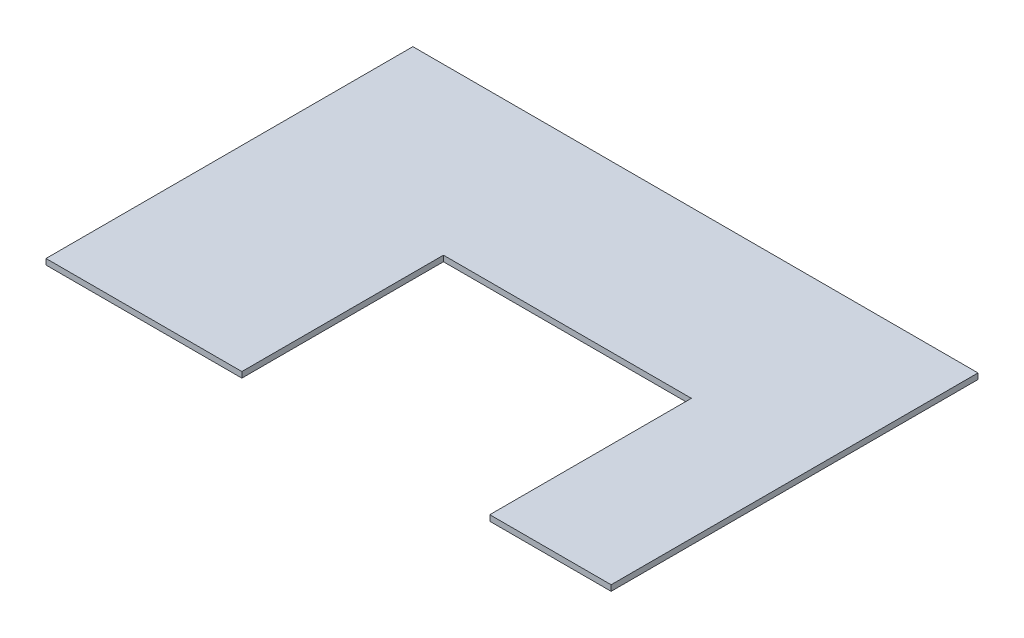
ISO-10303-21;
HEADER;
FILE_DESCRIPTION(('STEP AP214'),'2;1');
FILE_NAME('part.step','',(''),(''),'','','');
FILE_SCHEMA(('AUTOMOTIVE_DESIGN { 1 0 10303 214 1 1 1 1 }'));
ENDSEC;
DATA;
#1=APPLICATION_CONTEXT('core data for automotive mechanical design processes');
#2=APPLICATION_PROTOCOL_DEFINITION('international standard','automotive_design',2000,#1);
#3=PRODUCT_CONTEXT('',#1,'mechanical');
#4=PRODUCT('Part','Part','',(#3));
#5=PRODUCT_RELATED_PRODUCT_CATEGORY('part','',(#4));
#6=PRODUCT_DEFINITION_FORMATION('','',#4);
#7=PRODUCT_DEFINITION_CONTEXT('part definition',#1,'design');
#8=PRODUCT_DEFINITION('design','',#6,#7);
#9=PRODUCT_DEFINITION_SHAPE('','',#8);
#10=(LENGTH_UNIT() NAMED_UNIT(*) SI_UNIT(.MILLI.,.METRE.));
#11=(NAMED_UNIT(*) PLANE_ANGLE_UNIT() SI_UNIT($,.RADIAN.));
#12=(NAMED_UNIT(*) SI_UNIT($,.STERADIAN.) SOLID_ANGLE_UNIT());
#13=UNCERTAINTY_MEASURE_WITH_UNIT(LENGTH_MEASURE(1.E-05),#10,'distance_accuracy_value','');
#14=(GEOMETRIC_REPRESENTATION_CONTEXT(3) GLOBAL_UNCERTAINTY_ASSIGNED_CONTEXT((#13)) GLOBAL_UNIT_ASSIGNED_CONTEXT((#10,
#11,#12)) REPRESENTATION_CONTEXT('',''));
#15=CARTESIAN_POINT('',(0.,0.,0.));
#16=DIRECTION('',(0.,0.,1.));
#17=DIRECTION('',(1.,0.,0.));
#18=AXIS2_PLACEMENT_3D('',#15,#16,#17);
#19=CARTESIAN_POINT('',(0.,-19.05,0.));
#20=DIRECTION('',(0.,0.,1.));
#21=DIRECTION('',(1.,0.,0.));
#22=AXIS2_PLACEMENT_3D('',#19,#20,#21);
#23=PLANE('',#22);
#24=DIRECTION('',(1.,0.,0.));
#25=VECTOR('',#24,1.);
#26=CARTESIAN_POINT('',(0.,0.,0.));
#27=LINE('',#26,#25);
#28=CARTESIAN_POINT('',(0.,0.,0.));
#29=VERTEX_POINT('',#28);
#30=CARTESIAN_POINT('',(650.875,0.,0.));
#31=VERTEX_POINT('',#30);
#32=EDGE_CURVE('E135',#29,#31,#27,.T.);
#33=ORIENTED_EDGE('',*,*,#32,.F.);
#34=DIRECTION('',(0.,1.,0.));
#35=VECTOR('',#34,1.);
#36=CARTESIAN_POINT('',(0.,-19.05,0.));
#37=LINE('',#36,#35);
#38=CARTESIAN_POINT('',(0.,-19.05,0.));
#39=VERTEX_POINT('',#38);
#40=EDGE_CURVE('E11',#39,#29,#37,.T.);
#41=ORIENTED_EDGE('',*,*,#40,.F.);
#42=DIRECTION('',(1.,0.,0.));
#43=VECTOR('',#42,1.);
#44=CARTESIAN_POINT('',(0.,-19.05,0.));
#45=LINE('',#44,#43);
#46=CARTESIAN_POINT('',(650.875,-19.05,0.));
#47=VERTEX_POINT('',#46);
#48=EDGE_CURVE('E155',#39,#47,#45,.T.);
#49=ORIENTED_EDGE('',*,*,#48,.T.);
#50=DIRECTION('',(0.,1.,0.));
#51=VECTOR('',#50,1.);
#52=CARTESIAN_POINT('',(650.875,-19.05,0.));
#53=LINE('',#52,#51);
#54=EDGE_CURVE('E41',#47,#31,#53,.T.);
#55=ORIENTED_EDGE('',*,*,#54,.T.);
#56=EDGE_LOOP('',(#33,#41,#49,#55));
#57=FACE_BOUND('',#56,.T.);
#58=ADVANCED_FACE('F38',(#57),#23,.T.);
#59=CARTESIAN_POINT('',(-2.29534139493609E-13,-19.05,-1219.2));
#60=DIRECTION('',(-1.,0.,0.));
#61=DIRECTION('',(0.,0.,1.));
#62=AXIS2_PLACEMENT_3D('',#59,#60,#61);
#63=PLANE('',#62);
#64=DIRECTION('',(0.,0.,1.));
#65=VECTOR('',#64,1.);
#66=CARTESIAN_POINT('',(-2.29534139493609E-13,0.,-1219.2));
#67=LINE('',#66,#65);
#68=CARTESIAN_POINT('',(-2.29534139493609E-13,0.,-1219.2));
#69=VERTEX_POINT('',#68);
#70=EDGE_CURVE('E153',#69,#29,#67,.T.);
#71=ORIENTED_EDGE('',*,*,#70,.F.);
#72=DIRECTION('',(0.,1.,0.));
#73=VECTOR('',#72,1.);
#74=CARTESIAN_POINT('',(-2.29534139493609E-13,-19.05,-1219.2));
#75=LINE('',#74,#73);
#76=CARTESIAN_POINT('',(-2.29534139493609E-13,-19.05,-1219.2));
#77=VERTEX_POINT('',#76);
#78=EDGE_CURVE('E47',#77,#69,#75,.T.);
#79=ORIENTED_EDGE('',*,*,#78,.F.);
#80=DIRECTION('',(0.,0.,1.));
#81=VECTOR('',#80,1.);
#82=CARTESIAN_POINT('',(-2.29534139493609E-13,-19.05,-1219.2));
#83=LINE('',#82,#81);
#84=EDGE_CURVE('E125',#77,#39,#83,.T.);
#85=ORIENTED_EDGE('',*,*,#84,.T.);
#86=ORIENTED_EDGE('',*,*,#40,.T.);
#87=EDGE_LOOP('',(#71,#79,#85,#86));
#88=FACE_BOUND('',#87,.T.);
#89=ADVANCED_FACE('F167',(#88),#63,.T.);
#90=CARTESIAN_POINT('',(1878.0125,-19.05,-1219.2));
#91=DIRECTION('',(0.,0.,-1.));
#92=DIRECTION('',(-1.,0.,0.));
#93=AXIS2_PLACEMENT_3D('',#90,#91,#92);
#94=PLANE('',#93);
#95=DIRECTION('',(-1.,0.,0.));
#96=VECTOR('',#95,1.);
#97=CARTESIAN_POINT('',(1878.0125,0.,-1219.2));
#98=LINE('',#97,#96);
#99=CARTESIAN_POINT('',(1878.0125,0.,-1219.2));
#100=VERTEX_POINT('',#99);
#101=EDGE_CURVE('E112',#100,#69,#98,.T.);
#102=ORIENTED_EDGE('',*,*,#101,.F.);
#103=DIRECTION('',(0.,1.,0.));
#104=VECTOR('',#103,1.);
#105=CARTESIAN_POINT('',(1878.0125,-19.05,-1219.2));
#106=LINE('',#105,#104);
#107=CARTESIAN_POINT('',(1878.0125,-19.05,-1219.2));
#108=VERTEX_POINT('',#107);
#109=EDGE_CURVE('E107',#108,#100,#106,.T.);
#110=ORIENTED_EDGE('',*,*,#109,.F.);
#111=DIRECTION('',(-1.,0.,0.));
#112=VECTOR('',#111,1.);
#113=CARTESIAN_POINT('',(1878.0125,-19.05,-1219.2));
#114=LINE('',#113,#112);
#115=EDGE_CURVE('E110',#108,#77,#114,.T.);
#116=ORIENTED_EDGE('',*,*,#115,.T.);
#117=ORIENTED_EDGE('',*,*,#78,.T.);
#118=EDGE_LOOP('',(#102,#110,#116,#117));
#119=FACE_BOUND('',#118,.T.);
#120=ADVANCED_FACE('F109',(#119),#94,.T.);
#121=CARTESIAN_POINT('',(1878.0125,-19.05,0.));
#122=DIRECTION('',(1.,0.,0.));
#123=DIRECTION('',(0.,0.,-1.));
#124=AXIS2_PLACEMENT_3D('',#121,#122,#123);
#125=PLANE('',#124);
#126=DIRECTION('',(0.,0.,-1.));
#127=VECTOR('',#126,1.);
#128=CARTESIAN_POINT('',(1878.0125,0.,0.));
#129=LINE('',#128,#127);
#130=CARTESIAN_POINT('',(1878.0125,0.,0.));
#131=VERTEX_POINT('',#130);
#132=EDGE_CURVE('E150',#131,#100,#129,.T.);
#133=ORIENTED_EDGE('',*,*,#132,.F.);
#134=DIRECTION('',(0.,1.,0.));
#135=VECTOR('',#134,1.);
#136=CARTESIAN_POINT('',(1878.0125,-19.05,0.));
#137=LINE('',#136,#135);
#138=CARTESIAN_POINT('',(1878.0125,-19.05,0.));
#139=VERTEX_POINT('',#138);
#140=EDGE_CURVE('E117',#139,#131,#137,.T.);
#141=ORIENTED_EDGE('',*,*,#140,.F.);
#142=DIRECTION('',(0.,0.,-1.));
#143=VECTOR('',#142,1.);
#144=CARTESIAN_POINT('',(1878.0125,-19.05,0.));
#145=LINE('',#144,#143);
#146=EDGE_CURVE('E123',#139,#108,#145,.T.);
#147=ORIENTED_EDGE('',*,*,#146,.T.);
#148=ORIENTED_EDGE('',*,*,#109,.T.);
#149=EDGE_LOOP('',(#133,#141,#147,#148));
#150=FACE_BOUND('',#149,.T.);
#151=ADVANCED_FACE('F127',(#150),#125,.T.);
#152=CARTESIAN_POINT('',(1474.7875,-19.05,0.));
#153=DIRECTION('',(0.,0.,1.));
#154=DIRECTION('',(1.,0.,0.));
#155=AXIS2_PLACEMENT_3D('',#152,#153,#154);
#156=PLANE('',#155);
#157=DIRECTION('',(1.,0.,0.));
#158=VECTOR('',#157,1.);
#159=CARTESIAN_POINT('',(1474.7875,0.,0.));
#160=LINE('',#159,#158);
#161=CARTESIAN_POINT('',(1474.7875,0.,0.));
#162=VERTEX_POINT('',#161);
#163=EDGE_CURVE('E147',#162,#131,#160,.T.);
#164=ORIENTED_EDGE('',*,*,#163,.F.);
#165=DIRECTION('',(0.,1.,0.));
#166=VECTOR('',#165,1.);
#167=CARTESIAN_POINT('',(1474.7875,-19.05,0.));
#168=LINE('',#167,#166);
#169=CARTESIAN_POINT('',(1474.7875,-19.05,0.));
#170=VERTEX_POINT('',#169);
#171=EDGE_CURVE('E159',#170,#162,#168,.T.);
#172=ORIENTED_EDGE('',*,*,#171,.F.);
#173=DIRECTION('',(1.,0.,0.));
#174=VECTOR('',#173,1.);
#175=CARTESIAN_POINT('',(1474.7875,-19.05,0.));
#176=LINE('',#175,#174);
#177=EDGE_CURVE('E128',#170,#139,#176,.T.);
#178=ORIENTED_EDGE('',*,*,#177,.T.);
#179=ORIENTED_EDGE('',*,*,#140,.T.);
#180=EDGE_LOOP('',(#164,#172,#178,#179));
#181=FACE_BOUND('',#180,.T.);
#182=ADVANCED_FACE('F180',(#181),#156,.T.);
#183=CARTESIAN_POINT('',(1474.7875,-19.05,-669.925));
#184=DIRECTION('',(-1.,0.,0.));
#185=DIRECTION('',(0.,0.,1.));
#186=AXIS2_PLACEMENT_3D('',#183,#184,#185);
#187=PLANE('',#186);
#188=DIRECTION('',(0.,0.,1.));
#189=VECTOR('',#188,1.);
#190=CARTESIAN_POINT('',(1474.7875,0.,-669.925));
#191=LINE('',#190,#189);
#192=CARTESIAN_POINT('',(1474.7875,0.,-669.925));
#193=VERTEX_POINT('',#192);
#194=EDGE_CURVE('E144',#193,#162,#191,.T.);
#195=ORIENTED_EDGE('',*,*,#194,.F.);
#196=DIRECTION('',(0.,1.,0.));
#197=VECTOR('',#196,1.);
#198=CARTESIAN_POINT('',(1474.7875,-19.05,-669.925));
#199=LINE('',#198,#197);
#200=CARTESIAN_POINT('',(1474.7875,-19.05,-669.925));
#201=VERTEX_POINT('',#200);
#202=EDGE_CURVE('E161',#201,#193,#199,.T.);
#203=ORIENTED_EDGE('',*,*,#202,.F.);
#204=DIRECTION('',(0.,0.,1.));
#205=VECTOR('',#204,1.);
#206=CARTESIAN_POINT('',(1474.7875,-19.05,-669.925));
#207=LINE('',#206,#205);
#208=EDGE_CURVE('E130',#201,#170,#207,.T.);
#209=ORIENTED_EDGE('',*,*,#208,.T.);
#210=ORIENTED_EDGE('',*,*,#171,.T.);
#211=EDGE_LOOP('',(#195,#203,#209,#210));
#212=FACE_BOUND('',#211,.T.);
#213=ADVANCED_FACE('F183',(#212),#187,.T.);
#214=CARTESIAN_POINT('',(650.875,-19.05,-669.925));
#215=DIRECTION('',(0.,0.,1.));
#216=DIRECTION('',(1.,0.,0.));
#217=AXIS2_PLACEMENT_3D('',#214,#215,#216);
#218=PLANE('',#217);
#219=DIRECTION('',(1.,0.,0.));
#220=VECTOR('',#219,1.);
#221=CARTESIAN_POINT('',(650.875,0.,-669.925));
#222=LINE('',#221,#220);
#223=CARTESIAN_POINT('',(650.875,0.,-669.925));
#224=VERTEX_POINT('',#223);
#225=EDGE_CURVE('E141',#224,#193,#222,.T.);
#226=ORIENTED_EDGE('',*,*,#225,.F.);
#227=DIRECTION('',(0.,1.,0.));
#228=VECTOR('',#227,1.);
#229=CARTESIAN_POINT('',(650.875,-19.05,-669.925));
#230=LINE('',#229,#228);
#231=CARTESIAN_POINT('',(650.875,-19.05,-669.925));
#232=VERTEX_POINT('',#231);
#233=EDGE_CURVE('E162',#232,#224,#230,.T.);
#234=ORIENTED_EDGE('',*,*,#233,.F.);
#235=DIRECTION('',(1.,0.,0.));
#236=VECTOR('',#235,1.);
#237=CARTESIAN_POINT('',(650.875,-19.05,-669.925));
#238=LINE('',#237,#236);
#239=EDGE_CURVE('E258',#232,#201,#238,.T.);
#240=ORIENTED_EDGE('',*,*,#239,.T.);
#241=ORIENTED_EDGE('',*,*,#202,.T.);
#242=EDGE_LOOP('',(#226,#234,#240,#241));
#243=FACE_BOUND('',#242,.T.);
#244=ADVANCED_FACE('F187',(#243),#218,.T.);
#245=CARTESIAN_POINT('',(650.875,-19.05,0.));
#246=DIRECTION('',(1.,0.,0.));
#247=DIRECTION('',(0.,0.,-1.));
#248=AXIS2_PLACEMENT_3D('',#245,#246,#247);
#249=PLANE('',#248);
#250=DIRECTION('',(0.,0.,-1.));
#251=VECTOR('',#250,1.);
#252=CARTESIAN_POINT('',(650.875,0.,0.));
#253=LINE('',#252,#251);
#254=EDGE_CURVE('E138',#31,#224,#253,.T.);
#255=ORIENTED_EDGE('',*,*,#254,.F.);
#256=ORIENTED_EDGE('',*,*,#54,.F.);
#257=DIRECTION('',(0.,0.,-1.));
#258=VECTOR('',#257,1.);
#259=CARTESIAN_POINT('',(650.875,-19.05,0.));
#260=LINE('',#259,#258);
#261=EDGE_CURVE('E259',#47,#232,#260,.T.);
#262=ORIENTED_EDGE('',*,*,#261,.T.);
#263=ORIENTED_EDGE('',*,*,#233,.T.);
#264=EDGE_LOOP('',(#255,#256,#262,#263));
#265=FACE_BOUND('',#264,.T.);
#266=ADVANCED_FACE('F164',(#265),#249,.T.);
#267=CARTESIAN_POINT('',(0.,-19.05,0.));
#268=DIRECTION('',(0.,1.,0.));
#269=DIRECTION('',(0.,0.,1.));
#270=AXIS2_PLACEMENT_3D('',#267,#268,#269);
#271=PLANE('',#270);
#272=ORIENTED_EDGE('',*,*,#48,.F.);
#273=ORIENTED_EDGE('',*,*,#84,.F.);
#274=ORIENTED_EDGE('',*,*,#115,.F.);
#275=ORIENTED_EDGE('',*,*,#146,.F.);
#276=ORIENTED_EDGE('',*,*,#177,.F.);
#277=ORIENTED_EDGE('',*,*,#208,.F.);
#278=ORIENTED_EDGE('',*,*,#239,.F.);
#279=ORIENTED_EDGE('',*,*,#261,.F.);
#280=EDGE_LOOP('',(#272,#273,#274,#275,#276,#277,#278,#279));
#281=FACE_BOUND('',#280,.T.);
#282=ADVANCED_FACE('F121',(#281),#271,.F.);
#283=CARTESIAN_POINT('',(0.,0.,0.));
#284=DIRECTION('',(0.,1.,0.));
#285=DIRECTION('',(0.,0.,1.));
#286=AXIS2_PLACEMENT_3D('',#283,#284,#285);
#287=PLANE('',#286);
#288=ORIENTED_EDGE('',*,*,#32,.T.);
#289=ORIENTED_EDGE('',*,*,#254,.T.);
#290=ORIENTED_EDGE('',*,*,#225,.T.);
#291=ORIENTED_EDGE('',*,*,#194,.T.);
#292=ORIENTED_EDGE('',*,*,#163,.T.);
#293=ORIENTED_EDGE('',*,*,#132,.T.);
#294=ORIENTED_EDGE('',*,*,#101,.T.);
#295=ORIENTED_EDGE('',*,*,#70,.T.);
#296=EDGE_LOOP('',(#288,#289,#290,#291,#292,#293,#294,#295));
#297=FACE_BOUND('',#296,.T.);
#298=ADVANCED_FACE('F166',(#297),#287,.T.);
#299=CLOSED_SHELL('',(#58,#89,#120,#151,#182,#213,#244,#266,#282,#298));
#300=MANIFOLD_SOLID_BREP('B2',#299);
#301=ADVANCED_BREP_SHAPE_REPRESENTATION('',(#18,#300),#14);
#302=SHAPE_DEFINITION_REPRESENTATION(#9,#301);
ENDSEC;
END-ISO-10303-21;
